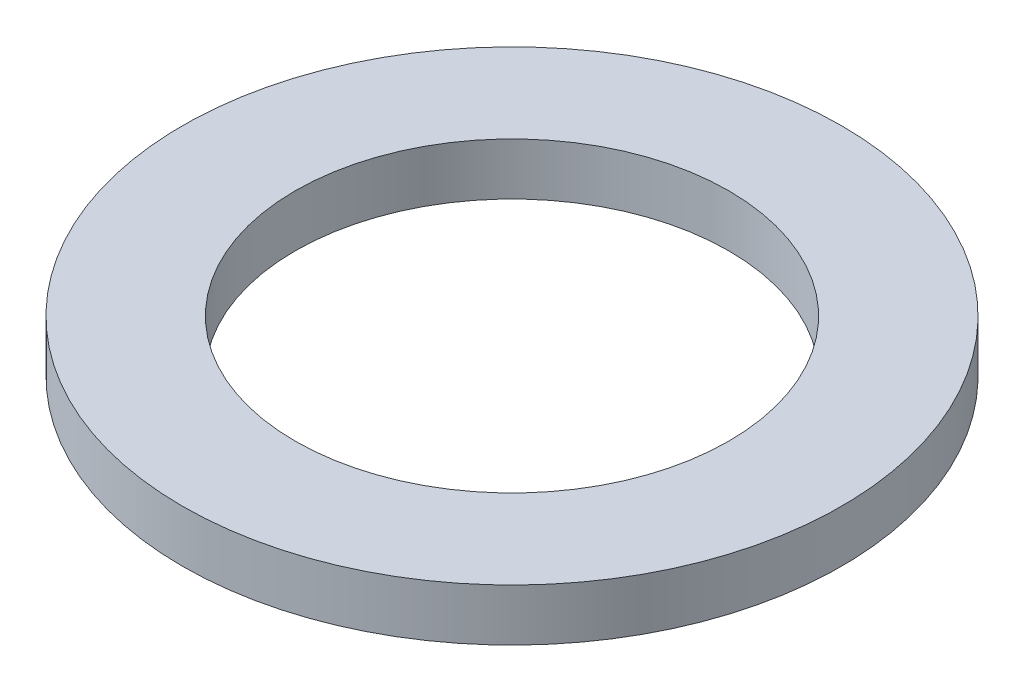
ISO-10303-21;
HEADER;
FILE_DESCRIPTION(('STEP AP214'),'2;1');
FILE_NAME('part.step','',(''),(''),'','','');
FILE_SCHEMA(('AUTOMOTIVE_DESIGN { 1 0 10303 214 1 1 1 1 }'));
ENDSEC;
DATA;
#1=APPLICATION_CONTEXT('core data for automotive mechanical design processes');
#2=APPLICATION_PROTOCOL_DEFINITION('international standard','automotive_design',2000,#1);
#3=PRODUCT_CONTEXT('',#1,'mechanical');
#4=PRODUCT('Part','Part','',(#3));
#5=PRODUCT_RELATED_PRODUCT_CATEGORY('part','',(#4));
#6=PRODUCT_DEFINITION_FORMATION('','',#4);
#7=PRODUCT_DEFINITION_CONTEXT('part definition',#1,'design');
#8=PRODUCT_DEFINITION('design','',#6,#7);
#9=PRODUCT_DEFINITION_SHAPE('','',#8);
#10=(LENGTH_UNIT() NAMED_UNIT(*) SI_UNIT(.MILLI.,.METRE.));
#11=(NAMED_UNIT(*) PLANE_ANGLE_UNIT() SI_UNIT($,.RADIAN.));
#12=(NAMED_UNIT(*) SI_UNIT($,.STERADIAN.) SOLID_ANGLE_UNIT());
#13=UNCERTAINTY_MEASURE_WITH_UNIT(LENGTH_MEASURE(1.E-05),#10,'distance_accuracy_value','');
#14=(GEOMETRIC_REPRESENTATION_CONTEXT(3) GLOBAL_UNCERTAINTY_ASSIGNED_CONTEXT((#13)) GLOBAL_UNIT_ASSIGNED_CONTEXT((#10,
#11,#12)) REPRESENTATION_CONTEXT('',''));
#15=CARTESIAN_POINT('',(0.,0.,0.));
#16=DIRECTION('',(0.,0.,1.));
#17=DIRECTION('',(1.,0.,0.));
#18=AXIS2_PLACEMENT_3D('',#15,#16,#17);
#19=CARTESIAN_POINT('',(0.,3.,0.));
#20=DIRECTION('',(0.,1.,0.));
#21=DIRECTION('',(0.,0.,1.));
#22=AXIS2_PLACEMENT_3D('',#19,#20,#21);
#23=PLANE('',#22);
#24=CARTESIAN_POINT('',(0.,3.,0.));
#25=DIRECTION('',(0.,1.,0.));
#26=DIRECTION('',(0.,0.,1.));
#27=AXIS2_PLACEMENT_3D('',#24,#25,#26);
#28=CIRCLE('',#27,19.);
#29=CARTESIAN_POINT('',(0.,3.,19.));
#30=VERTEX_POINT('',#29);
#31=EDGE_CURVE('E10',#30,#30,#28,.T.);
#32=ORIENTED_EDGE('',*,*,#31,.T.);
#33=EDGE_LOOP('',(#32));
#34=FACE_BOUND('',#33,.T.);
#35=CARTESIAN_POINT('',(0.,3.,0.));
#36=DIRECTION('',(0.,1.,0.));
#37=DIRECTION('',(0.,0.,1.));
#38=AXIS2_PLACEMENT_3D('',#35,#36,#37);
#39=CIRCLE('',#38,12.5);
#40=CARTESIAN_POINT('',(0.,3.,12.5));
#41=VERTEX_POINT('',#40);
#42=EDGE_CURVE('E50',#41,#41,#39,.T.);
#43=ORIENTED_EDGE('',*,*,#42,.F.);
#44=EDGE_LOOP('',(#43));
#45=FACE_BOUND('',#44,.T.);
#46=ADVANCED_FACE('F37',(#34,#45),#23,.T.);
#47=CARTESIAN_POINT('',(0.,0.,0.));
#48=DIRECTION('',(0.,1.,0.));
#49=DIRECTION('',(0.,0.,1.));
#50=AXIS2_PLACEMENT_3D('',#47,#48,#49);
#51=PLANE('',#50);
#52=CARTESIAN_POINT('',(0.,0.,0.));
#53=DIRECTION('',(0.,1.,0.));
#54=DIRECTION('',(0.,0.,1.));
#55=AXIS2_PLACEMENT_3D('',#52,#53,#54);
#56=CIRCLE('',#55,19.);
#57=CARTESIAN_POINT('',(0.,0.,19.));
#58=VERTEX_POINT('',#57);
#59=EDGE_CURVE('E41',#58,#58,#56,.T.);
#60=ORIENTED_EDGE('',*,*,#59,.F.);
#61=EDGE_LOOP('',(#60));
#62=FACE_BOUND('',#61,.T.);
#63=CARTESIAN_POINT('',(0.,0.,0.));
#64=DIRECTION('',(0.,1.,0.));
#65=DIRECTION('',(0.,0.,1.));
#66=AXIS2_PLACEMENT_3D('',#63,#64,#65);
#67=CIRCLE('',#66,12.5);
#68=CARTESIAN_POINT('',(0.,0.,12.5));
#69=VERTEX_POINT('',#68);
#70=EDGE_CURVE('E52',#69,#69,#67,.T.);
#71=ORIENTED_EDGE('',*,*,#70,.T.);
#72=EDGE_LOOP('',(#71));
#73=FACE_BOUND('',#72,.T.);
#74=ADVANCED_FACE('F64',(#62,#73),#51,.F.);
#75=CARTESIAN_POINT('',(0.,3.,0.));
#76=DIRECTION('',(0.,-1.,0.));
#77=DIRECTION('',(0.,0.,-1.));
#78=AXIS2_PLACEMENT_3D('',#75,#76,#77);
#79=CYLINDRICAL_SURFACE('',#78,19.);
#80=ORIENTED_EDGE('',*,*,#31,.F.);
#81=EDGE_LOOP('',(#80));
#82=FACE_BOUND('',#81,.T.);
#83=ORIENTED_EDGE('',*,*,#59,.T.);
#84=EDGE_LOOP('',(#83));
#85=FACE_BOUND('',#84,.T.);
#86=ADVANCED_FACE('F39',(#82,#85),#79,.T.);
#87=CARTESIAN_POINT('',(0.,3.,0.));
#88=DIRECTION('',(0.,-1.,0.));
#89=DIRECTION('',(0.,0.,-1.));
#90=AXIS2_PLACEMENT_3D('',#87,#88,#89);
#91=CYLINDRICAL_SURFACE('',#90,12.5);
#92=ORIENTED_EDGE('',*,*,#42,.T.);
#93=EDGE_LOOP('',(#92));
#94=FACE_BOUND('',#93,.T.);
#95=ORIENTED_EDGE('',*,*,#70,.F.);
#96=EDGE_LOOP('',(#95));
#97=FACE_BOUND('',#96,.T.);
#98=ADVANCED_FACE('F60',(#94,#97),#91,.F.);
#99=CLOSED_SHELL('',(#46,#74,#86,#98));
#100=MANIFOLD_SOLID_BREP('B2',#99);
#101=ADVANCED_BREP_SHAPE_REPRESENTATION('',(#18,#100),#14);
#102=SHAPE_DEFINITION_REPRESENTATION(#9,#101);
ENDSEC;
END-ISO-10303-21;
